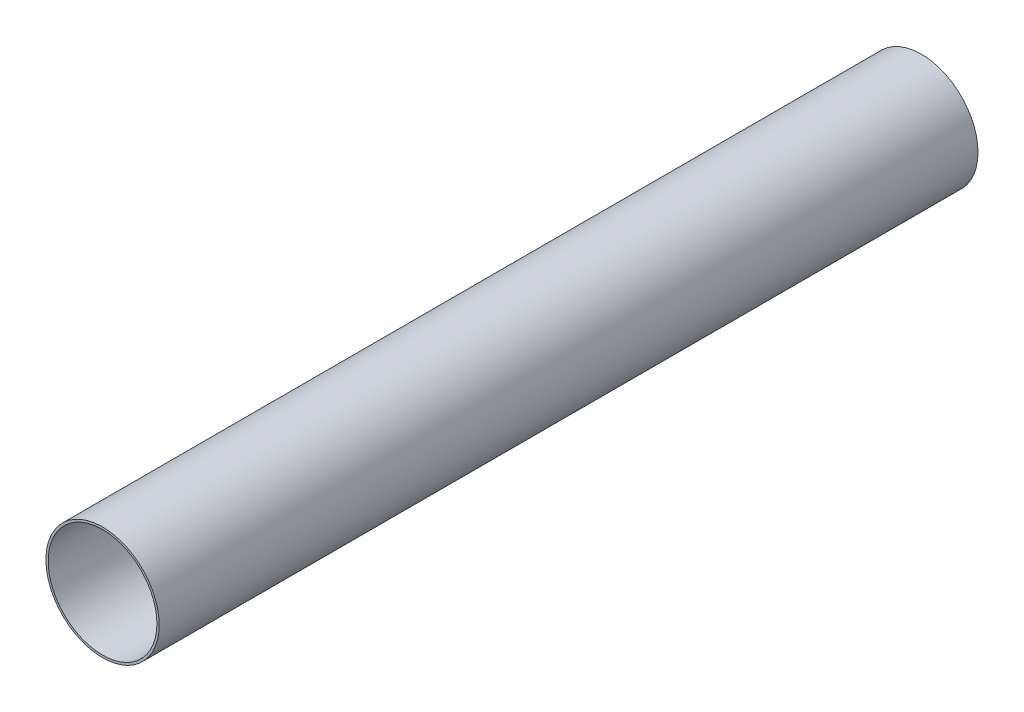
ISO-10303-21;
HEADER;
FILE_DESCRIPTION(('STEP AP214'),'2;1');
FILE_NAME('part.step','',(''),(''),'','','');
FILE_SCHEMA(('AUTOMOTIVE_DESIGN { 1 0 10303 214 1 1 1 1 }'));
ENDSEC;
DATA;
#1=APPLICATION_CONTEXT('core data for automotive mechanical design processes');
#2=APPLICATION_PROTOCOL_DEFINITION('international standard','automotive_design',2000,#1);
#3=PRODUCT_CONTEXT('',#1,'mechanical');
#4=PRODUCT('Part','Part','',(#3));
#5=PRODUCT_RELATED_PRODUCT_CATEGORY('part','',(#4));
#6=PRODUCT_DEFINITION_FORMATION('','',#4);
#7=PRODUCT_DEFINITION_CONTEXT('part definition',#1,'design');
#8=PRODUCT_DEFINITION('design','',#6,#7);
#9=PRODUCT_DEFINITION_SHAPE('','',#8);
#10=(LENGTH_UNIT() NAMED_UNIT(*) SI_UNIT(.MILLI.,.METRE.));
#11=(NAMED_UNIT(*) PLANE_ANGLE_UNIT() SI_UNIT($,.RADIAN.));
#12=(NAMED_UNIT(*) SI_UNIT($,.STERADIAN.) SOLID_ANGLE_UNIT());
#13=UNCERTAINTY_MEASURE_WITH_UNIT(LENGTH_MEASURE(1.E-05),#10,'distance_accuracy_value','');
#14=(GEOMETRIC_REPRESENTATION_CONTEXT(3) GLOBAL_UNCERTAINTY_ASSIGNED_CONTEXT((#13)) GLOBAL_UNIT_ASSIGNED_CONTEXT((#10,
#11,#12)) REPRESENTATION_CONTEXT('',''));
#15=CARTESIAN_POINT('',(0.,0.,0.));
#16=DIRECTION('',(0.,0.,1.));
#17=DIRECTION('',(1.,0.,0.));
#18=AXIS2_PLACEMENT_3D('',#15,#16,#17);
#19=CARTESIAN_POINT('',(0.,0.,798.));
#20=DIRECTION('',(0.,0.,1.));
#21=DIRECTION('',(1.,0.,0.));
#22=AXIS2_PLACEMENT_3D('',#19,#20,#21);
#23=PLANE('',#22);
#24=CARTESIAN_POINT('',(0.,0.,798.));
#25=DIRECTION('',(0.,0.,1.));
#26=DIRECTION('',(1.,0.,0.));
#27=AXIS2_PLACEMENT_3D('',#24,#25,#26);
#28=CIRCLE('',#27,55.2000000000001);
#29=CARTESIAN_POINT('',(55.2000000000001,0.,798.));
#30=VERTEX_POINT('',#29);
#31=EDGE_CURVE('E10',#30,#30,#28,.T.);
#32=ORIENTED_EDGE('',*,*,#31,.T.);
#33=EDGE_LOOP('',(#32));
#34=FACE_BOUND('',#33,.T.);
#35=CARTESIAN_POINT('',(0.,0.,798.));
#36=DIRECTION('',(0.,0.,1.));
#37=DIRECTION('',(1.,0.,0.));
#38=AXIS2_PLACEMENT_3D('',#35,#36,#37);
#39=CIRCLE('',#38,53.);
#40=CARTESIAN_POINT('',(53.,0.,798.));
#41=VERTEX_POINT('',#40);
#42=EDGE_CURVE('E44',#41,#41,#39,.T.);
#43=ORIENTED_EDGE('',*,*,#42,.F.);
#44=EDGE_LOOP('',(#43));
#45=FACE_BOUND('',#44,.T.);
#46=ADVANCED_FACE('F33',(#34,#45),#23,.T.);
#47=CARTESIAN_POINT('',(0.,0.,0.));
#48=DIRECTION('',(0.,0.,1.));
#49=DIRECTION('',(1.,0.,0.));
#50=AXIS2_PLACEMENT_3D('',#47,#48,#49);
#51=PLANE('',#50);
#52=CARTESIAN_POINT('',(0.,0.,0.));
#53=DIRECTION('',(0.,0.,1.));
#54=DIRECTION('',(1.,0.,0.));
#55=AXIS2_PLACEMENT_3D('',#52,#53,#54);
#56=CIRCLE('',#55,55.2000000000001);
#57=CARTESIAN_POINT('',(55.2000000000001,0.,0.));
#58=VERTEX_POINT('',#57);
#59=EDGE_CURVE('E37',#58,#58,#56,.T.);
#60=ORIENTED_EDGE('',*,*,#59,.F.);
#61=EDGE_LOOP('',(#60));
#62=FACE_BOUND('',#61,.T.);
#63=CARTESIAN_POINT('',(0.,0.,0.));
#64=DIRECTION('',(0.,0.,1.));
#65=DIRECTION('',(1.,0.,0.));
#66=AXIS2_PLACEMENT_3D('',#63,#64,#65);
#67=CIRCLE('',#66,53.);
#68=CARTESIAN_POINT('',(53.,0.,0.));
#69=VERTEX_POINT('',#68);
#70=EDGE_CURVE('E46',#69,#69,#67,.T.);
#71=ORIENTED_EDGE('',*,*,#70,.T.);
#72=EDGE_LOOP('',(#71));
#73=FACE_BOUND('',#72,.T.);
#74=ADVANCED_FACE('F56',(#62,#73),#51,.F.);
#75=CARTESIAN_POINT('',(0.,0.,798.));
#76=DIRECTION('',(0.,0.,-1.));
#77=DIRECTION('',(-1.,0.,0.));
#78=AXIS2_PLACEMENT_3D('',#75,#76,#77);
#79=CYLINDRICAL_SURFACE('',#78,55.2000000000001);
#80=ORIENTED_EDGE('',*,*,#31,.F.);
#81=EDGE_LOOP('',(#80));
#82=FACE_BOUND('',#81,.T.);
#83=ORIENTED_EDGE('',*,*,#59,.T.);
#84=EDGE_LOOP('',(#83));
#85=FACE_BOUND('',#84,.T.);
#86=ADVANCED_FACE('F35',(#82,#85),#79,.T.);
#87=CARTESIAN_POINT('',(0.,0.,798.));
#88=DIRECTION('',(0.,0.,-1.));
#89=DIRECTION('',(-1.,0.,0.));
#90=AXIS2_PLACEMENT_3D('',#87,#88,#89);
#91=CYLINDRICAL_SURFACE('',#90,53.);
#92=ORIENTED_EDGE('',*,*,#42,.T.);
#93=EDGE_LOOP('',(#92));
#94=FACE_BOUND('',#93,.T.);
#95=ORIENTED_EDGE('',*,*,#70,.F.);
#96=EDGE_LOOP('',(#95));
#97=FACE_BOUND('',#96,.T.);
#98=ADVANCED_FACE('F52',(#94,#97),#91,.F.);
#99=CLOSED_SHELL('',(#46,#74,#86,#98));
#100=MANIFOLD_SOLID_BREP('B2',#99);
#101=ADVANCED_BREP_SHAPE_REPRESENTATION('',(#18,#100),#14);
#102=SHAPE_DEFINITION_REPRESENTATION(#9,#101);
ENDSEC;
END-ISO-10303-21;
